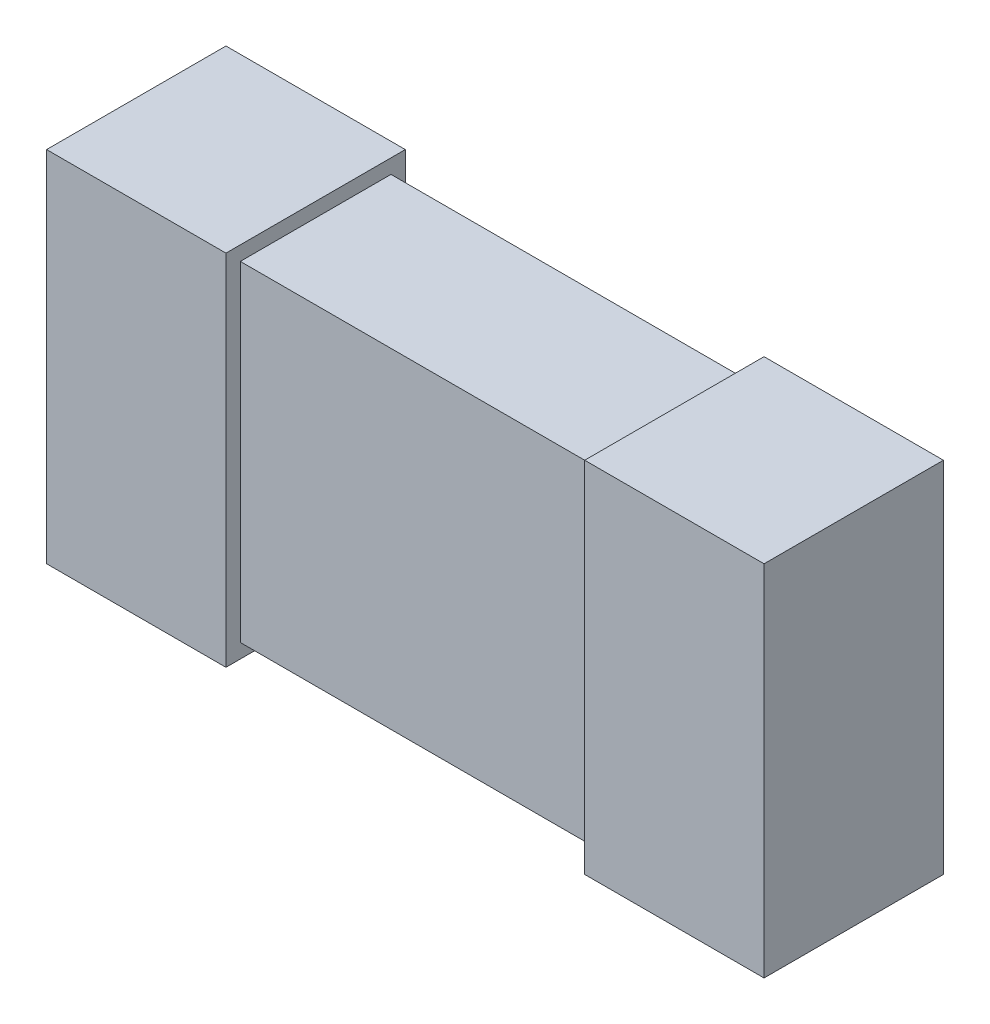
ISO-10303-21;
HEADER;
FILE_DESCRIPTION(('STEP AP214'),'2;1');
FILE_NAME('part.step','',(''),(''),'','','');
FILE_SCHEMA(('AUTOMOTIVE_DESIGN { 1 0 10303 214 1 1 1 1 }'));
ENDSEC;
DATA;
#1=APPLICATION_CONTEXT('core data for automotive mechanical design processes');
#2=APPLICATION_PROTOCOL_DEFINITION('international standard','automotive_design',2000,#1);
#3=PRODUCT_CONTEXT('',#1,'mechanical');
#4=PRODUCT('Part','Part','',(#3));
#5=PRODUCT_RELATED_PRODUCT_CATEGORY('part','',(#4));
#6=PRODUCT_DEFINITION_FORMATION('','',#4);
#7=PRODUCT_DEFINITION_CONTEXT('part definition',#1,'design');
#8=PRODUCT_DEFINITION('design','',#6,#7);
#9=PRODUCT_DEFINITION_SHAPE('','',#8);
#10=(LENGTH_UNIT() NAMED_UNIT(*) SI_UNIT(.MILLI.,.METRE.));
#11=(NAMED_UNIT(*) PLANE_ANGLE_UNIT() SI_UNIT($,.RADIAN.));
#12=(NAMED_UNIT(*) SI_UNIT($,.STERADIAN.) SOLID_ANGLE_UNIT());
#13=UNCERTAINTY_MEASURE_WITH_UNIT(LENGTH_MEASURE(1.E-05),#10,'distance_accuracy_value','');
#14=(GEOMETRIC_REPRESENTATION_CONTEXT(3) GLOBAL_UNCERTAINTY_ASSIGNED_CONTEXT((#13)) GLOBAL_UNIT_ASSIGNED_CONTEXT((#10,
#11,#12)) REPRESENTATION_CONTEXT('',''));
#15=CARTESIAN_POINT('',(0.,0.,0.));
#16=DIRECTION('',(0.,0.,1.));
#17=DIRECTION('',(1.,0.,0.));
#18=AXIS2_PLACEMENT_3D('',#15,#16,#17);
#19=CARTESIAN_POINT('',(0.5,-0.26,-0.005));
#20=DIRECTION('',(1.,0.,0.));
#21=DIRECTION('',(0.,0.,-1.));
#22=AXIS2_PLACEMENT_3D('',#19,#20,#21);
#23=PLANE('',#22);
#24=DIRECTION('',(0.,1.,0.));
#25=VECTOR('',#24,1.);
#26=CARTESIAN_POINT('',(0.5,-0.26,0.));
#27=LINE('',#26,#25);
#28=CARTESIAN_POINT('',(0.5,-0.25,0.));
#29=VERTEX_POINT('',#28);
#30=CARTESIAN_POINT('',(0.5,0.25,0.));
#31=VERTEX_POINT('',#30);
#32=EDGE_CURVE('E108',#29,#31,#27,.T.);
#33=ORIENTED_EDGE('',*,*,#32,.T.);
#34=DIRECTION('',(0.,0.,1.));
#35=VECTOR('',#34,1.);
#36=CARTESIAN_POINT('',(0.5,0.25,-0.005));
#37=LINE('',#36,#35);
#38=CARTESIAN_POINT('',(0.5,0.25,0.25));
#39=VERTEX_POINT('',#38);
#40=EDGE_CURVE('E102',#39,#31,#37,.F.);
#41=ORIENTED_EDGE('',*,*,#40,.F.);
#42=DIRECTION('',(0.,1.,0.));
#43=VECTOR('',#42,1.);
#44=CARTESIAN_POINT('',(0.5,-0.26,0.25));
#45=LINE('',#44,#43);
#46=CARTESIAN_POINT('',(0.5,-0.25,0.25));
#47=VERTEX_POINT('',#46);
#48=EDGE_CURVE('E110',#47,#39,#45,.T.);
#49=ORIENTED_EDGE('',*,*,#48,.F.);
#50=DIRECTION('',(0.,0.,-1.));
#51=VECTOR('',#50,1.);
#52=CARTESIAN_POINT('',(0.5,-0.25,-0.005));
#53=LINE('',#52,#51);
#54=EDGE_CURVE('E20',#29,#47,#53,.F.);
#55=ORIENTED_EDGE('',*,*,#54,.F.);
#56=EDGE_LOOP('',(#33,#41,#49,#55));
#57=FACE_BOUND('',#56,.T.);
#58=ADVANCED_FACE('F17',(#57),#23,.T.);
#59=CARTESIAN_POINT('',(-0.5,0.26,-0.005));
#60=DIRECTION('',(-1.,0.,0.));
#61=DIRECTION('',(0.,0.,1.));
#62=AXIS2_PLACEMENT_3D('',#59,#60,#61);
#63=PLANE('',#62);
#64=DIRECTION('',(0.,1.,0.));
#65=VECTOR('',#64,1.);
#66=CARTESIAN_POINT('',(-0.5,-0.26,0.));
#67=LINE('',#66,#65);
#68=CARTESIAN_POINT('',(-0.5,0.25,0.));
#69=VERTEX_POINT('',#68);
#70=CARTESIAN_POINT('',(-0.5,-0.25,0.));
#71=VERTEX_POINT('',#70);
#72=EDGE_CURVE('E143',#69,#71,#67,.F.);
#73=ORIENTED_EDGE('',*,*,#72,.T.);
#74=DIRECTION('',(0.,0.,-1.));
#75=VECTOR('',#74,1.);
#76=CARTESIAN_POINT('',(-0.5,-0.25,-0.005));
#77=LINE('',#76,#75);
#78=CARTESIAN_POINT('',(-0.5,-0.25,0.25));
#79=VERTEX_POINT('',#78);
#80=EDGE_CURVE('E135',#79,#71,#77,.T.);
#81=ORIENTED_EDGE('',*,*,#80,.F.);
#82=DIRECTION('',(0.,1.,0.));
#83=VECTOR('',#82,1.);
#84=CARTESIAN_POINT('',(-0.5,-0.26,0.25));
#85=LINE('',#84,#83);
#86=CARTESIAN_POINT('',(-0.5,0.25,0.25));
#87=VERTEX_POINT('',#86);
#88=EDGE_CURVE('E133',#87,#79,#85,.F.);
#89=ORIENTED_EDGE('',*,*,#88,.F.);
#90=DIRECTION('',(0.,0.,1.));
#91=VECTOR('',#90,1.);
#92=CARTESIAN_POINT('',(-0.5,0.25,-0.005));
#93=LINE('',#92,#91);
#94=EDGE_CURVE('E146',#69,#87,#93,.T.);
#95=ORIENTED_EDGE('',*,*,#94,.F.);
#96=EDGE_LOOP('',(#73,#81,#89,#95));
#97=FACE_BOUND('',#96,.T.);
#98=ADVANCED_FACE('F258',(#97),#63,.T.);
#99=CARTESIAN_POINT('',(-0.52,-0.25,-0.005));
#100=DIRECTION('',(0.,-1.,0.));
#101=DIRECTION('',(0.,0.,-1.));
#102=AXIS2_PLACEMENT_3D('',#99,#100,#101);
#103=PLANE('',#102);
#104=DIRECTION('',(0.,0.,-1.));
#105=VECTOR('',#104,1.);
#106=CARTESIAN_POINT('',(0.25,-0.25,0.255));
#107=LINE('',#106,#105);
#108=CARTESIAN_POINT('',(0.25,-0.25,0.25));
#109=VERTEX_POINT('',#108);
#110=CARTESIAN_POINT('',(0.25,-0.25,0.));
#111=VERTEX_POINT('',#110);
#112=EDGE_CURVE('E124',#109,#111,#107,.T.);
#113=ORIENTED_EDGE('',*,*,#112,.T.);
#114=DIRECTION('',(1.,0.,0.));
#115=VECTOR('',#114,1.);
#116=CARTESIAN_POINT('',(-0.52,-0.25,0.));
#117=LINE('',#116,#115);
#118=EDGE_CURVE('E115',#111,#29,#117,.T.);
#119=ORIENTED_EDGE('',*,*,#118,.T.);
#120=ORIENTED_EDGE('',*,*,#54,.T.);
#121=DIRECTION('',(1.,0.,0.));
#122=VECTOR('',#121,1.);
#123=CARTESIAN_POINT('',(-0.52,-0.25,0.25));
#124=LINE('',#123,#122);
#125=EDGE_CURVE('E131',#109,#47,#124,.T.);
#126=ORIENTED_EDGE('',*,*,#125,.F.);
#127=EDGE_LOOP('',(#113,#119,#120,#126));
#128=FACE_BOUND('',#127,.T.);
#129=ADVANCED_FACE('F123',(#128),#103,.T.);
#130=CARTESIAN_POINT('',(-0.52,-0.26,0.));
#131=DIRECTION('',(0.,0.,1.));
#132=DIRECTION('',(1.,0.,0.));
#133=AXIS2_PLACEMENT_3D('',#130,#131,#132);
#134=PLANE('',#133);
#135=ORIENTED_EDGE('',*,*,#118,.F.);
#136=DIRECTION('',(0.,1.,0.));
#137=VECTOR('',#136,1.);
#138=CARTESIAN_POINT('',(0.25,-0.26,0.));
#139=LINE('',#138,#137);
#140=CARTESIAN_POINT('',(0.25,0.25,0.));
#141=VERTEX_POINT('',#140);
#142=EDGE_CURVE('E162',#111,#141,#139,.T.);
#143=ORIENTED_EDGE('',*,*,#142,.T.);
#144=DIRECTION('',(1.,0.,0.));
#145=VECTOR('',#144,1.);
#146=CARTESIAN_POINT('',(0.52,0.25,0.));
#147=LINE('',#146,#145);
#148=EDGE_CURVE('E120',#31,#141,#147,.F.);
#149=ORIENTED_EDGE('',*,*,#148,.F.);
#150=ORIENTED_EDGE('',*,*,#32,.F.);
#151=EDGE_LOOP('',(#135,#143,#149,#150));
#152=FACE_BOUND('',#151,.T.);
#153=ADVANCED_FACE('F117',(#152),#134,.F.);
#154=CARTESIAN_POINT('',(0.52,0.25,-0.005));
#155=DIRECTION('',(0.,1.,0.));
#156=DIRECTION('',(0.,0.,1.));
#157=AXIS2_PLACEMENT_3D('',#154,#155,#156);
#158=PLANE('',#157);
#159=DIRECTION('',(0.,0.,-1.));
#160=VECTOR('',#159,1.);
#161=CARTESIAN_POINT('',(0.25,0.25,0.255));
#162=LINE('',#161,#160);
#163=CARTESIAN_POINT('',(0.25,0.25,0.25));
#164=VERTEX_POINT('',#163);
#165=EDGE_CURVE('E164',#141,#164,#162,.F.);
#166=ORIENTED_EDGE('',*,*,#165,.T.);
#167=DIRECTION('',(1.,0.,0.));
#168=VECTOR('',#167,1.);
#169=CARTESIAN_POINT('',(-0.52,0.25,0.25));
#170=LINE('',#169,#168);
#171=EDGE_CURVE('E129',#39,#164,#170,.F.);
#172=ORIENTED_EDGE('',*,*,#171,.F.);
#173=ORIENTED_EDGE('',*,*,#40,.T.);
#174=ORIENTED_EDGE('',*,*,#148,.T.);
#175=EDGE_LOOP('',(#166,#172,#173,#174));
#176=FACE_BOUND('',#175,.T.);
#177=ADVANCED_FACE('F251',(#176),#158,.T.);
#178=CARTESIAN_POINT('',(-0.52,-0.26,0.25));
#179=DIRECTION('',(0.,0.,1.));
#180=DIRECTION('',(1.,0.,0.));
#181=AXIS2_PLACEMENT_3D('',#178,#179,#180);
#182=PLANE('',#181);
#183=DIRECTION('',(0.,1.,0.));
#184=VECTOR('',#183,1.);
#185=CARTESIAN_POINT('',(0.25,-0.26,0.25));
#186=LINE('',#185,#184);
#187=EDGE_CURVE('E167',#164,#109,#186,.F.);
#188=ORIENTED_EDGE('',*,*,#187,.T.);
#189=ORIENTED_EDGE('',*,*,#125,.T.);
#190=ORIENTED_EDGE('',*,*,#48,.T.);
#191=ORIENTED_EDGE('',*,*,#171,.T.);
#192=EDGE_LOOP('',(#188,#189,#190,#191));
#193=FACE_BOUND('',#192,.T.);
#194=ADVANCED_FACE('F247',(#193),#182,.T.);
#195=CARTESIAN_POINT('',(-0.26,0.2392,0.02));
#196=DIRECTION('',(0.,0.,1.));
#197=DIRECTION('',(1.,0.,0.));
#198=AXIS2_PLACEMENT_3D('',#195,#196,#197);
#199=PLANE('',#198);
#200=DIRECTION('',(1.,0.,0.));
#201=VECTOR('',#200,1.);
#202=CARTESIAN_POINT('',(-0.26,0.23,0.02));
#203=LINE('',#202,#201);
#204=CARTESIAN_POINT('',(-0.25,0.23,0.02));
#205=VERTEX_POINT('',#204);
#206=CARTESIAN_POINT('',(0.25,0.23,0.02));
#207=VERTEX_POINT('',#206);
#208=EDGE_CURVE('E153',#205,#207,#203,.T.);
#209=ORIENTED_EDGE('',*,*,#208,.T.);
#210=DIRECTION('',(0.,1.,0.));
#211=VECTOR('',#210,1.);
#212=CARTESIAN_POINT('',(0.25,-0.26,0.02));
#213=LINE('',#212,#211);
#214=CARTESIAN_POINT('',(0.25,-0.23,0.02));
#215=VERTEX_POINT('',#214);
#216=EDGE_CURVE('E156',#207,#215,#213,.F.);
#217=ORIENTED_EDGE('',*,*,#216,.T.);
#218=DIRECTION('',(1.,0.,0.));
#219=VECTOR('',#218,1.);
#220=CARTESIAN_POINT('',(-0.26,-0.23,0.02));
#221=LINE('',#220,#219);
#222=CARTESIAN_POINT('',(-0.25,-0.23,0.02));
#223=VERTEX_POINT('',#222);
#224=EDGE_CURVE('E173',#215,#223,#221,.F.);
#225=ORIENTED_EDGE('',*,*,#224,.T.);
#226=DIRECTION('',(0.,1.,0.));
#227=VECTOR('',#226,1.);
#228=CARTESIAN_POINT('',(-0.25,-0.26,0.02));
#229=LINE('',#228,#227);
#230=EDGE_CURVE('E179',#205,#223,#229,.F.);
#231=ORIENTED_EDGE('',*,*,#230,.F.);
#232=EDGE_LOOP('',(#209,#217,#225,#231));
#233=FACE_BOUND('',#232,.T.);
#234=ADVANCED_FACE('F243',(#233),#199,.F.);
#235=CARTESIAN_POINT('',(-0.52,-0.26,0.25));
#236=DIRECTION('',(0.,0.,1.));
#237=DIRECTION('',(1.,0.,0.));
#238=AXIS2_PLACEMENT_3D('',#235,#236,#237);
#239=PLANE('',#238);
#240=DIRECTION('',(0.,1.,0.));
#241=VECTOR('',#240,1.);
#242=CARTESIAN_POINT('',(-0.25,-0.26,0.25));
#243=LINE('',#242,#241);
#244=CARTESIAN_POINT('',(-0.25,0.25,0.25));
#245=VERTEX_POINT('',#244);
#246=CARTESIAN_POINT('',(-0.25,-0.25,0.25));
#247=VERTEX_POINT('',#246);
#248=EDGE_CURVE('E182',#245,#247,#243,.F.);
#249=ORIENTED_EDGE('',*,*,#248,.F.);
#250=DIRECTION('',(1.,0.,0.));
#251=VECTOR('',#250,1.);
#252=CARTESIAN_POINT('',(0.52,0.25,0.25));
#253=LINE('',#252,#251);
#254=EDGE_CURVE('E148',#87,#245,#253,.T.);
#255=ORIENTED_EDGE('',*,*,#254,.F.);
#256=ORIENTED_EDGE('',*,*,#88,.T.);
#257=DIRECTION('',(1.,0.,0.));
#258=VECTOR('',#257,1.);
#259=CARTESIAN_POINT('',(-0.52,-0.25,0.25));
#260=LINE('',#259,#258);
#261=EDGE_CURVE('E137',#247,#79,#260,.F.);
#262=ORIENTED_EDGE('',*,*,#261,.F.);
#263=EDGE_LOOP('',(#249,#255,#256,#262));
#264=FACE_BOUND('',#263,.T.);
#265=ADVANCED_FACE('F239',(#264),#239,.T.);
#266=CARTESIAN_POINT('',(-0.52,-0.25,-0.005));
#267=DIRECTION('',(0.,-1.,0.));
#268=DIRECTION('',(0.,0.,-1.));
#269=AXIS2_PLACEMENT_3D('',#266,#267,#268);
#270=PLANE('',#269);
#271=DIRECTION('',(0.,0.,-1.));
#272=VECTOR('',#271,1.);
#273=CARTESIAN_POINT('',(-0.25,-0.25,0.255));
#274=LINE('',#273,#272);
#275=CARTESIAN_POINT('',(-0.25,-0.25,0.));
#276=VERTEX_POINT('',#275);
#277=EDGE_CURVE('E184',#247,#276,#274,.T.);
#278=ORIENTED_EDGE('',*,*,#277,.F.);
#279=ORIENTED_EDGE('',*,*,#261,.T.);
#280=ORIENTED_EDGE('',*,*,#80,.T.);
#281=DIRECTION('',(1.,0.,0.));
#282=VECTOR('',#281,1.);
#283=CARTESIAN_POINT('',(-0.52,-0.25,0.));
#284=LINE('',#283,#282);
#285=EDGE_CURVE('E140',#71,#276,#284,.T.);
#286=ORIENTED_EDGE('',*,*,#285,.T.);
#287=EDGE_LOOP('',(#278,#279,#280,#286));
#288=FACE_BOUND('',#287,.T.);
#289=ADVANCED_FACE('F235',(#288),#270,.T.);
#290=CARTESIAN_POINT('',(-0.52,-0.26,0.));
#291=DIRECTION('',(0.,0.,1.));
#292=DIRECTION('',(1.,0.,0.));
#293=AXIS2_PLACEMENT_3D('',#290,#291,#292);
#294=PLANE('',#293);
#295=DIRECTION('',(1.,0.,0.));
#296=VECTOR('',#295,1.);
#297=CARTESIAN_POINT('',(0.52,0.25,0.));
#298=LINE('',#297,#296);
#299=CARTESIAN_POINT('',(-0.25,0.25,0.));
#300=VERTEX_POINT('',#299);
#301=EDGE_CURVE('E150',#300,#69,#298,.F.);
#302=ORIENTED_EDGE('',*,*,#301,.F.);
#303=DIRECTION('',(0.,1.,0.));
#304=VECTOR('',#303,1.);
#305=CARTESIAN_POINT('',(-0.25,-0.26,0.));
#306=LINE('',#305,#304);
#307=EDGE_CURVE('E186',#276,#300,#306,.T.);
#308=ORIENTED_EDGE('',*,*,#307,.F.);
#309=ORIENTED_EDGE('',*,*,#285,.F.);
#310=ORIENTED_EDGE('',*,*,#72,.F.);
#311=EDGE_LOOP('',(#302,#308,#309,#310));
#312=FACE_BOUND('',#311,.T.);
#313=ADVANCED_FACE('F231',(#312),#294,.F.);
#314=CARTESIAN_POINT('',(0.52,0.25,-0.005));
#315=DIRECTION('',(0.,1.,0.));
#316=DIRECTION('',(0.,0.,1.));
#317=AXIS2_PLACEMENT_3D('',#314,#315,#316);
#318=PLANE('',#317);
#319=DIRECTION('',(0.,0.,-1.));
#320=VECTOR('',#319,1.);
#321=CARTESIAN_POINT('',(-0.25,0.25,0.255));
#322=LINE('',#321,#320);
#323=EDGE_CURVE('E188',#300,#245,#322,.F.);
#324=ORIENTED_EDGE('',*,*,#323,.F.);
#325=ORIENTED_EDGE('',*,*,#301,.T.);
#326=ORIENTED_EDGE('',*,*,#94,.T.);
#327=ORIENTED_EDGE('',*,*,#254,.T.);
#328=EDGE_LOOP('',(#324,#325,#326,#327));
#329=FACE_BOUND('',#328,.T.);
#330=ADVANCED_FACE('F228',(#329),#318,.T.);
#331=CARTESIAN_POINT('',(-0.26,0.23,0.2342));
#332=DIRECTION('',(0.,-1.,0.));
#333=DIRECTION('',(0.,0.,-1.));
#334=AXIS2_PLACEMENT_3D('',#331,#332,#333);
#335=PLANE('',#334);
#336=DIRECTION('',(-1.,0.,0.));
#337=VECTOR('',#336,1.);
#338=CARTESIAN_POINT('',(-0.26,0.23,0.23));
#339=LINE('',#338,#337);
#340=CARTESIAN_POINT('',(-0.25,0.23,0.23));
#341=VERTEX_POINT('',#340);
#342=CARTESIAN_POINT('',(0.25,0.23,0.23));
#343=VERTEX_POINT('',#342);
#344=EDGE_CURVE('E191',#341,#343,#339,.F.);
#345=ORIENTED_EDGE('',*,*,#344,.T.);
#346=DIRECTION('',(0.,0.,-1.));
#347=VECTOR('',#346,1.);
#348=CARTESIAN_POINT('',(0.25,0.23,0.255));
#349=LINE('',#348,#347);
#350=EDGE_CURVE('E158',#343,#207,#349,.T.);
#351=ORIENTED_EDGE('',*,*,#350,.T.);
#352=ORIENTED_EDGE('',*,*,#208,.F.);
#353=DIRECTION('',(0.,0.,-1.));
#354=VECTOR('',#353,1.);
#355=CARTESIAN_POINT('',(-0.25,0.23,0.255));
#356=LINE('',#355,#354);
#357=EDGE_CURVE('E176',#341,#205,#356,.T.);
#358=ORIENTED_EDGE('',*,*,#357,.F.);
#359=EDGE_LOOP('',(#345,#351,#352,#358));
#360=FACE_BOUND('',#359,.T.);
#361=ADVANCED_FACE('F208',(#360),#335,.F.);
#362=CARTESIAN_POINT('',(0.25,-0.26,0.255));
#363=DIRECTION('',(1.,0.,0.));
#364=DIRECTION('',(0.,0.,-1.));
#365=AXIS2_PLACEMENT_3D('',#362,#363,#364);
#366=PLANE('',#365);
#367=ORIENTED_EDGE('',*,*,#165,.F.);
#368=ORIENTED_EDGE('',*,*,#142,.F.);
#369=ORIENTED_EDGE('',*,*,#112,.F.);
#370=ORIENTED_EDGE('',*,*,#187,.F.);
#371=EDGE_LOOP('',(#367,#368,#369,#370));
#372=FACE_BOUND('',#371,.T.);
#373=DIRECTION('',(0.,1.,0.));
#374=VECTOR('',#373,1.);
#375=CARTESIAN_POINT('',(0.25,-0.2392,0.23));
#376=LINE('',#375,#374);
#377=CARTESIAN_POINT('',(0.25,-0.23,0.23));
#378=VERTEX_POINT('',#377);
#379=EDGE_CURVE('E194',#343,#378,#376,.F.);
#380=ORIENTED_EDGE('',*,*,#379,.T.);
#381=DIRECTION('',(0.,0.,1.));
#382=VECTOR('',#381,1.);
#383=CARTESIAN_POINT('',(0.25,-0.23,0.0158));
#384=LINE('',#383,#382);
#385=EDGE_CURVE('E170',#378,#215,#384,.F.);
#386=ORIENTED_EDGE('',*,*,#385,.T.);
#387=ORIENTED_EDGE('',*,*,#216,.F.);
#388=ORIENTED_EDGE('',*,*,#350,.F.);
#389=EDGE_LOOP('',(#380,#386,#387,#388));
#390=FACE_BOUND('',#389,.T.);
#391=ADVANCED_FACE('F206',(#372,#390),#366,.F.);
#392=CARTESIAN_POINT('',(-0.26,-0.23,0.0158));
#393=DIRECTION('',(0.,1.,0.));
#394=DIRECTION('',(0.,0.,1.));
#395=AXIS2_PLACEMENT_3D('',#392,#393,#394);
#396=PLANE('',#395);
#397=ORIENTED_EDGE('',*,*,#224,.F.);
#398=ORIENTED_EDGE('',*,*,#385,.F.);
#399=DIRECTION('',(-1.,0.,0.));
#400=VECTOR('',#399,1.);
#401=CARTESIAN_POINT('',(-0.26,-0.23,0.23));
#402=LINE('',#401,#400);
#403=CARTESIAN_POINT('',(-0.25,-0.23,0.23));
#404=VERTEX_POINT('',#403);
#405=EDGE_CURVE('E26',#378,#404,#402,.T.);
#406=ORIENTED_EDGE('',*,*,#405,.T.);
#407=DIRECTION('',(0.,0.,-1.));
#408=VECTOR('',#407,1.);
#409=CARTESIAN_POINT('',(-0.25,-0.23,0.255));
#410=LINE('',#409,#408);
#411=EDGE_CURVE('E34',#223,#404,#410,.F.);
#412=ORIENTED_EDGE('',*,*,#411,.F.);
#413=EDGE_LOOP('',(#397,#398,#406,#412));
#414=FACE_BOUND('',#413,.T.);
#415=ADVANCED_FACE('F201',(#414),#396,.F.);
#416=CARTESIAN_POINT('',(-0.25,-0.26,0.255));
#417=DIRECTION('',(1.,0.,0.));
#418=DIRECTION('',(0.,0.,-1.));
#419=AXIS2_PLACEMENT_3D('',#416,#417,#418);
#420=PLANE('',#419);
#421=ORIENTED_EDGE('',*,*,#307,.T.);
#422=ORIENTED_EDGE('',*,*,#323,.T.);
#423=ORIENTED_EDGE('',*,*,#248,.T.);
#424=ORIENTED_EDGE('',*,*,#277,.T.);
#425=EDGE_LOOP('',(#421,#422,#423,#424));
#426=FACE_BOUND('',#425,.T.);
#427=ORIENTED_EDGE('',*,*,#411,.T.);
#428=DIRECTION('',(0.,1.,0.));
#429=VECTOR('',#428,1.);
#430=CARTESIAN_POINT('',(-0.25,-0.2392,0.23));
#431=LINE('',#430,#429);
#432=EDGE_CURVE('E11',#404,#341,#431,.T.);
#433=ORIENTED_EDGE('',*,*,#432,.T.);
#434=ORIENTED_EDGE('',*,*,#357,.T.);
#435=ORIENTED_EDGE('',*,*,#230,.T.);
#436=EDGE_LOOP('',(#427,#433,#434,#435));
#437=FACE_BOUND('',#436,.T.);
#438=ADVANCED_FACE('F211',(#426,#437),#420,.T.);
#439=CARTESIAN_POINT('',(-0.26,-0.2392,0.23));
#440=DIRECTION('',(0.,0.,-1.));
#441=DIRECTION('',(-1.,0.,0.));
#442=AXIS2_PLACEMENT_3D('',#439,#440,#441);
#443=PLANE('',#442);
#444=ORIENTED_EDGE('',*,*,#405,.F.);
#445=ORIENTED_EDGE('',*,*,#379,.F.);
#446=ORIENTED_EDGE('',*,*,#344,.F.);
#447=ORIENTED_EDGE('',*,*,#432,.F.);
#448=EDGE_LOOP('',(#444,#445,#446,#447));
#449=FACE_BOUND('',#448,.T.);
#450=ADVANCED_FACE('F204',(#449),#443,.F.);
#451=CLOSED_SHELL('',(#58,#98,#129,#153,#177,#194,#234,#265,#289,#313,#330,#361,#391,#415,#438,#450));
#452=MANIFOLD_SOLID_BREP('B1',#451);
#453=ADVANCED_BREP_SHAPE_REPRESENTATION('',(#18,#452),#14);
#454=SHAPE_DEFINITION_REPRESENTATION(#9,#453);
ENDSEC;
END-ISO-10303-21;
